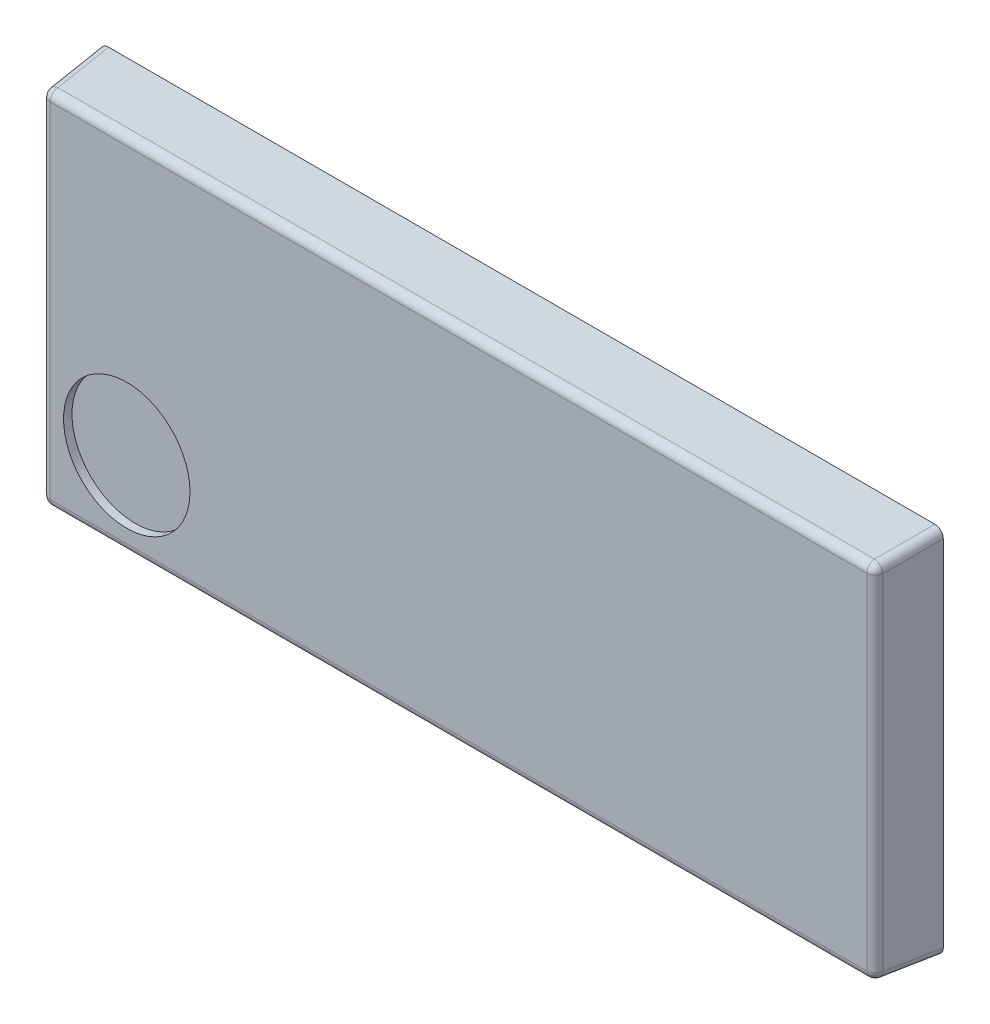
ISO-10303-21;
HEADER;
FILE_DESCRIPTION(('STEP AP214'),'2;1');
FILE_NAME('part.step','',(''),(''),'','','');
FILE_SCHEMA(('AUTOMOTIVE_DESIGN { 1 0 10303 214 1 1 1 1 }'));
ENDSEC;
DATA;
#1=APPLICATION_CONTEXT('core data for automotive mechanical design processes');
#2=APPLICATION_PROTOCOL_DEFINITION('international standard','automotive_design',2000,#1);
#3=PRODUCT_CONTEXT('',#1,'mechanical');
#4=PRODUCT('Part','Part','',(#3));
#5=PRODUCT_RELATED_PRODUCT_CATEGORY('part','',(#4));
#6=PRODUCT_DEFINITION_FORMATION('','',#4);
#7=PRODUCT_DEFINITION_CONTEXT('part definition',#1,'design');
#8=PRODUCT_DEFINITION('design','',#6,#7);
#9=PRODUCT_DEFINITION_SHAPE('','',#8);
#10=(LENGTH_UNIT() NAMED_UNIT(*) SI_UNIT(.MILLI.,.METRE.));
#11=(NAMED_UNIT(*) PLANE_ANGLE_UNIT() SI_UNIT($,.RADIAN.));
#12=(NAMED_UNIT(*) SI_UNIT($,.STERADIAN.) SOLID_ANGLE_UNIT());
#13=UNCERTAINTY_MEASURE_WITH_UNIT(LENGTH_MEASURE(1.E-05),#10,'distance_accuracy_value','');
#14=(GEOMETRIC_REPRESENTATION_CONTEXT(3) GLOBAL_UNCERTAINTY_ASSIGNED_CONTEXT((#13)) GLOBAL_UNIT_ASSIGNED_CONTEXT((#10,
#11,#12)) REPRESENTATION_CONTEXT('',''));
#15=CARTESIAN_POINT('',(0.,0.,0.));
#16=DIRECTION('',(0.,0.,1.));
#17=DIRECTION('',(1.,0.,0.));
#18=AXIS2_PLACEMENT_3D('',#15,#16,#17);
#19=CARTESIAN_POINT('',(-3.93438350235556,-1.13438350235556,0.65));
#20=DIRECTION('',(0.,0.,1.));
#21=DIRECTION('',(1.,0.,0.));
#22=AXIS2_PLACEMENT_3D('',#19,#20,#21);
#23=CYLINDRICAL_SURFACE('',#22,0.75);
#24=CARTESIAN_POINT('',(-3.93438350235556,-1.13438350235556,0.65));
#25=DIRECTION('',(0.,0.,1.));
#26=DIRECTION('',(1.,0.,0.));
#27=AXIS2_PLACEMENT_3D('',#24,#25,#26);
#28=CIRCLE('',#27,0.75);
#29=CARTESIAN_POINT('',(-3.18438350235556,-1.13438350235556,0.65));
#30=VERTEX_POINT('',#29);
#31=EDGE_CURVE('E11',#30,#30,#28,.T.);
#32=ORIENTED_EDGE('',*,*,#31,.F.);
#33=EDGE_LOOP('',(#32));
#34=FACE_BOUND('',#33,.T.);
#35=CARTESIAN_POINT('',(-3.93438350235556,-1.13438350235556,0.75));
#36=DIRECTION('',(0.,0.,-1.));
#37=DIRECTION('',(1.,0.,0.));
#38=AXIS2_PLACEMENT_3D('',#35,#36,#37);
#39=CIRCLE('',#38,0.75);
#40=CARTESIAN_POINT('',(-3.18438350235556,-1.13438350235556,0.75));
#41=VERTEX_POINT('',#40);
#42=EDGE_CURVE('E26',#41,#41,#39,.T.);
#43=ORIENTED_EDGE('',*,*,#42,.F.);
#44=EDGE_LOOP('',(#43));
#45=FACE_BOUND('',#44,.T.);
#46=ADVANCED_FACE('F16',(#34,#45),#23,.F.);
#47=CARTESIAN_POINT('',(-3.93438350235556,-1.13438350235556,0.65));
#48=DIRECTION('',(0.,0.,1.));
#49=DIRECTION('',(1.,0.,0.));
#50=AXIS2_PLACEMENT_3D('',#47,#48,#49);
#51=PLANE('',#50);
#52=ORIENTED_EDGE('',*,*,#31,.T.);
#53=EDGE_LOOP('',(#52));
#54=FACE_BOUND('',#53,.T.);
#55=ADVANCED_FACE('F352',(#54),#51,.T.);
#56=CARTESIAN_POINT('',(-5.,-2.2,0.75));
#57=DIRECTION('',(0.,0.,1.));
#58=DIRECTION('',(1.,0.,0.));
#59=AXIS2_PLACEMENT_3D('',#56,#57,#58);
#60=PLANE('',#59);
#61=DIRECTION('',(0.,1.,0.));
#62=VECTOR('',#61,1.);
#63=CARTESIAN_POINT('',(-4.84275038495381,-2.2,0.75));
#64=LINE('',#63,#62);
#65=CARTESIAN_POINT('',(-4.84275038495381,-2.04275038495382,0.75));
#66=VERTEX_POINT('',#65);
#67=CARTESIAN_POINT('',(-4.84275038495382,2.04275038495382,0.75));
#68=VERTEX_POINT('',#67);
#69=EDGE_CURVE('E253',#66,#68,#64,.T.);
#70=ORIENTED_EDGE('',*,*,#69,.F.);
#71=DIRECTION('',(-1.,0.,0.));
#72=VECTOR('',#71,1.);
#73=CARTESIAN_POINT('',(-5.,-2.04275038495382,0.75));
#74=LINE('',#73,#72);
#75=CARTESIAN_POINT('',(4.84275038495382,-2.04275038495382,0.75));
#76=VERTEX_POINT('',#75);
#77=EDGE_CURVE('E226',#76,#66,#74,.T.);
#78=ORIENTED_EDGE('',*,*,#77,.F.);
#79=DIRECTION('',(0.,-1.,0.));
#80=VECTOR('',#79,1.);
#81=CARTESIAN_POINT('',(4.84275038495382,-2.2,0.75));
#82=LINE('',#81,#80);
#83=CARTESIAN_POINT('',(4.84275038495382,2.04275038495382,0.75));
#84=VERTEX_POINT('',#83);
#85=EDGE_CURVE('E182',#84,#76,#82,.T.);
#86=ORIENTED_EDGE('',*,*,#85,.F.);
#87=DIRECTION('',(1.,0.,0.));
#88=VECTOR('',#87,1.);
#89=CARTESIAN_POINT('',(-5.,2.04275038495382,0.75));
#90=LINE('',#89,#88);
#91=EDGE_CURVE('E204',#68,#84,#90,.T.);
#92=ORIENTED_EDGE('',*,*,#91,.F.);
#93=EDGE_LOOP('',(#70,#78,#86,#92));
#94=FACE_BOUND('',#93,.T.);
#95=ORIENTED_EDGE('',*,*,#42,.T.);
#96=EDGE_LOOP('',(#95));
#97=FACE_BOUND('',#96,.T.);
#98=ADVANCED_FACE('F335',(#94,#97),#60,.T.);
#99=CARTESIAN_POINT('',(-4.84275038495382,2.04275038495382,0.65));
#100=DIRECTION('',(0.754900044750237,0.,0.655839860359288));
#101=DIRECTION('',(-0.35970845950189,-0.836170262039085,0.414039994498438));
#102=AXIS2_PLACEMENT_3D('',#99,#100,#101);
#103=SPHERICAL_SURFACE('',#102,0.0999999999999953);
#104=CARTESIAN_POINT('',(-4.84275038495382,2.04275038495382,0.65));
#105=DIRECTION('',(0.,-1.,0.));
#106=DIRECTION('',(1.,0.,0.));
#107=AXIS2_PLACEMENT_3D('',#104,#105,#106);
#108=CIRCLE('',#107,0.1);
#109=CARTESIAN_POINT('',(-4.94236985476299,2.04275038495382,0.658715574274766));
#110=VERTEX_POINT('',#109);
#111=EDGE_CURVE('E169',#68,#110,#108,.T.);
#112=ORIENTED_EDGE('',*,*,#111,.F.);
#113=CARTESIAN_POINT('',(-4.84275038495382,2.04275038495382,0.65));
#114=DIRECTION('',(1.,0.,0.));
#115=DIRECTION('',(0.,0.,1.));
#116=AXIS2_PLACEMENT_3D('',#113,#114,#115);
#117=CIRCLE('',#116,0.1);
#118=CARTESIAN_POINT('',(-4.84275038495382,2.14236985476299,0.658715574274766));
#119=VERTEX_POINT('',#118);
#120=EDGE_CURVE('E235',#119,#68,#117,.T.);
#121=ORIENTED_EDGE('',*,*,#120,.F.);
#122=CARTESIAN_POINT('',(-4.84275038495382,2.04275038495382,0.65));
#123=DIRECTION('',(-0.0868265938642476,0.0868265938642477,-0.992432509138967));
#124=DIRECTION('',(-0.996194698091746,0.,0.0871557427476582));
#125=AXIS2_PLACEMENT_3D('',#122,#123,#124);
#126=CIRCLE('',#125,0.1);
#127=EDGE_CURVE('E136',#110,#119,#126,.T.);
#128=ORIENTED_EDGE('',*,*,#127,.F.);
#129=EDGE_LOOP('',(#112,#121,#128));
#130=FACE_BOUND('',#129,.T.);
#131=ADVANCED_FACE('F360',(#130),#103,.T.);
#132=CARTESIAN_POINT('',(-4.84275038495381,-2.2,0.65));
#133=DIRECTION('',(0.,-1.,0.));
#134=DIRECTION('',(1.,0.,0.));
#135=AXIS2_PLACEMENT_3D('',#132,#133,#134);
#136=CYLINDRICAL_SURFACE('',#135,0.1);
#137=ORIENTED_EDGE('',*,*,#111,.T.);
#138=DIRECTION('',(0.,1.,0.));
#139=VECTOR('',#138,1.);
#140=CARTESIAN_POINT('',(-4.94236985476299,2.2,0.658715574274766));
#141=LINE('',#140,#139);
#142=CARTESIAN_POINT('',(-4.94236985476299,-2.04275038495382,0.658715574274766));
#143=VERTEX_POINT('',#142);
#144=EDGE_CURVE('E170',#143,#110,#141,.T.);
#145=ORIENTED_EDGE('',*,*,#144,.F.);
#146=CARTESIAN_POINT('',(-4.84275038495381,-2.04275038495382,0.65));
#147=DIRECTION('',(0.,-1.,0.));
#148=DIRECTION('',(1.,0.,0.));
#149=AXIS2_PLACEMENT_3D('',#146,#147,#148);
#150=CIRCLE('',#149,0.1);
#151=EDGE_CURVE('E257',#66,#143,#150,.T.);
#152=ORIENTED_EDGE('',*,*,#151,.F.);
#153=ORIENTED_EDGE('',*,*,#69,.T.);
#154=EDGE_LOOP('',(#137,#145,#152,#153));
#155=FACE_BOUND('',#154,.T.);
#156=ADVANCED_FACE('F333',(#155),#136,.T.);
#157=CARTESIAN_POINT('',(-4.84275038495381,-2.04275038495382,0.65));
#158=DIRECTION('',(0.754900044750258,0.,0.655839860359263));
#159=DIRECTION('',(0.359708459501881,-0.83617026203908,-0.414039994498455));
#160=AXIS2_PLACEMENT_3D('',#157,#158,#159);
#161=SPHERICAL_SURFACE('',#160,0.1);
#162=CARTESIAN_POINT('',(-4.84275038495381,-2.04275038495382,0.65));
#163=DIRECTION('',(-0.0868265938642476,-0.0868265938642476,-0.992432509138967));
#164=DIRECTION('',(0.,0.996194698091746,-0.0871557427476582));
#165=AXIS2_PLACEMENT_3D('',#162,#163,#164);
#166=CIRCLE('',#165,0.1);
#167=CARTESIAN_POINT('',(-4.84275038495381,-2.14236985476299,0.658715574274766));
#168=VERTEX_POINT('',#167);
#169=EDGE_CURVE('E173',#168,#143,#166,.T.);
#170=ORIENTED_EDGE('',*,*,#169,.F.);
#171=CARTESIAN_POINT('',(-4.84275038495381,-2.04275038495382,0.65));
#172=DIRECTION('',(1.,0.,0.));
#173=DIRECTION('',(0.,0.,-1.));
#174=AXIS2_PLACEMENT_3D('',#171,#172,#173);
#175=CIRCLE('',#174,0.1);
#176=EDGE_CURVE('E222',#66,#168,#175,.T.);
#177=ORIENTED_EDGE('',*,*,#176,.F.);
#178=ORIENTED_EDGE('',*,*,#151,.T.);
#179=EDGE_LOOP('',(#170,#177,#178));
#180=FACE_BOUND('',#179,.T.);
#181=ADVANCED_FACE('F322',(#180),#161,.T.);
#182=CARTESIAN_POINT('',(-5.,-2.04275038495382,0.65));
#183=DIRECTION('',(1.,0.,0.));
#184=DIRECTION('',(0.,0.,-1.));
#185=AXIS2_PLACEMENT_3D('',#182,#183,#184);
#186=CYLINDRICAL_SURFACE('',#185,0.1);
#187=CARTESIAN_POINT('',(4.84275038495382,-2.04275038495382,0.65));
#188=DIRECTION('',(1.,0.,0.));
#189=DIRECTION('',(0.,1.,0.));
#190=AXIS2_PLACEMENT_3D('',#187,#188,#189);
#191=CIRCLE('',#190,0.1);
#192=CARTESIAN_POINT('',(4.84275038495382,-2.14236985476299,0.658715574274766));
#193=VERTEX_POINT('',#192);
#194=EDGE_CURVE('E227',#76,#193,#191,.T.);
#195=ORIENTED_EDGE('',*,*,#194,.F.);
#196=ORIENTED_EDGE('',*,*,#77,.T.);
#197=ORIENTED_EDGE('',*,*,#176,.T.);
#198=DIRECTION('',(-1.,0.,0.));
#199=VECTOR('',#198,1.);
#200=CARTESIAN_POINT('',(-5.,-2.14236985476299,0.658715574274766));
#201=LINE('',#200,#199);
#202=EDGE_CURVE('E187',#193,#168,#201,.T.);
#203=ORIENTED_EDGE('',*,*,#202,.F.);
#204=EDGE_LOOP('',(#195,#196,#197,#203));
#205=FACE_BOUND('',#204,.T.);
#206=ADVANCED_FACE('F324',(#205),#186,.T.);
#207=CARTESIAN_POINT('',(4.84275038495382,-2.04275038495383,0.650000000000008));
#208=DIRECTION('',(0.754900044750239,0.,-0.655839860359286));
#209=DIRECTION('',(-0.359708459501833,-0.836170262039141,-0.414039994498374));
#210=AXIS2_PLACEMENT_3D('',#207,#208,#209);
#211=SPHERICAL_SURFACE('',#210,0.0999999999999815);
#212=CARTESIAN_POINT('',(4.84275038495382,-2.04275038495382,0.65));
#213=DIRECTION('',(0.0868265938642476,-0.0868265938642477,-0.992432509138967));
#214=DIRECTION('',(-0.996194698091746,0.,-0.0871557427476582));
#215=AXIS2_PLACEMENT_3D('',#212,#213,#214);
#216=CIRCLE('',#215,0.1);
#217=CARTESIAN_POINT('',(4.94236985476299,-2.04275038495382,0.658715574274766));
#218=VERTEX_POINT('',#217);
#219=EDGE_CURVE('E221',#218,#193,#216,.T.);
#220=ORIENTED_EDGE('',*,*,#219,.F.);
#221=CARTESIAN_POINT('',(4.84275038495382,-2.04275038495382,0.65));
#222=DIRECTION('',(0.,1.,0.));
#223=DIRECTION('',(-1.,0.,0.));
#224=AXIS2_PLACEMENT_3D('',#221,#222,#223);
#225=CIRCLE('',#224,0.1);
#226=EDGE_CURVE('E178',#76,#218,#225,.T.);
#227=ORIENTED_EDGE('',*,*,#226,.F.);
#228=ORIENTED_EDGE('',*,*,#194,.T.);
#229=EDGE_LOOP('',(#220,#227,#228));
#230=FACE_BOUND('',#229,.T.);
#231=ADVANCED_FACE('F347',(#230),#211,.T.);
#232=CARTESIAN_POINT('',(4.84275038495382,-2.2,0.65));
#233=DIRECTION('',(0.,1.,0.));
#234=DIRECTION('',(-1.,0.,0.));
#235=AXIS2_PLACEMENT_3D('',#232,#233,#234);
#236=CYLINDRICAL_SURFACE('',#235,0.1);
#237=CARTESIAN_POINT('',(4.84275038495381,2.04275038495382,0.65));
#238=DIRECTION('',(0.,1.,0.));
#239=DIRECTION('',(1.,0.,0.));
#240=AXIS2_PLACEMENT_3D('',#237,#238,#239);
#241=CIRCLE('',#240,0.1);
#242=CARTESIAN_POINT('',(4.94236985476299,2.04275038495382,0.658715574274766));
#243=VERTEX_POINT('',#242);
#244=EDGE_CURVE('E183',#84,#243,#241,.T.);
#245=ORIENTED_EDGE('',*,*,#244,.F.);
#246=ORIENTED_EDGE('',*,*,#85,.T.);
#247=ORIENTED_EDGE('',*,*,#226,.T.);
#248=DIRECTION('',(0.,-1.,0.));
#249=VECTOR('',#248,1.);
#250=CARTESIAN_POINT('',(4.94236985476299,2.2,0.658715574274766));
#251=LINE('',#250,#249);
#252=EDGE_CURVE('E198',#243,#218,#251,.T.);
#253=ORIENTED_EDGE('',*,*,#252,.F.);
#254=EDGE_LOOP('',(#245,#246,#247,#253));
#255=FACE_BOUND('',#254,.T.);
#256=ADVANCED_FACE('F338',(#255),#236,.T.);
#257=CARTESIAN_POINT('',(4.84275038495383,2.04275038495383,0.650000000000024));
#258=DIRECTION('',(0.754900044750219,0.,-0.655839860359308));
#259=DIRECTION('',(0.35970845950193,-0.836170262039056,0.414039994498461));
#260=AXIS2_PLACEMENT_3D('',#257,#258,#259);
#261=SPHERICAL_SURFACE('',#260,0.0999999999999689);
#262=ORIENTED_EDGE('',*,*,#244,.T.);
#263=CARTESIAN_POINT('',(4.84275038495382,2.04275038495382,0.65));
#264=DIRECTION('',(0.0868265938642476,0.0868265938642476,-0.992432509138967));
#265=DIRECTION('',(0.,0.996194698091746,0.0871557427476582));
#266=AXIS2_PLACEMENT_3D('',#263,#264,#265);
#267=CIRCLE('',#266,0.1);
#268=CARTESIAN_POINT('',(4.84275038495382,2.14236985476299,0.658715574274766));
#269=VERTEX_POINT('',#268);
#270=EDGE_CURVE('E164',#269,#243,#267,.T.);
#271=ORIENTED_EDGE('',*,*,#270,.F.);
#272=CARTESIAN_POINT('',(4.84275038495382,2.04275038495382,0.65));
#273=DIRECTION('',(-1.,0.,0.));
#274=DIRECTION('',(0.,0.,1.));
#275=AXIS2_PLACEMENT_3D('',#272,#273,#274);
#276=CIRCLE('',#275,0.1);
#277=EDGE_CURVE('E208',#84,#269,#276,.T.);
#278=ORIENTED_EDGE('',*,*,#277,.F.);
#279=EDGE_LOOP('',(#262,#271,#278));
#280=FACE_BOUND('',#279,.T.);
#281=ADVANCED_FACE('F339',(#280),#261,.T.);
#282=CARTESIAN_POINT('',(-5.,2.04275038495382,0.65));
#283=DIRECTION('',(-1.,0.,0.));
#284=DIRECTION('',(0.,0.,1.));
#285=AXIS2_PLACEMENT_3D('',#282,#283,#284);
#286=CYLINDRICAL_SURFACE('',#285,0.1);
#287=ORIENTED_EDGE('',*,*,#277,.T.);
#288=DIRECTION('',(1.,0.,0.));
#289=VECTOR('',#288,1.);
#290=CARTESIAN_POINT('',(-5.,2.14236985476299,0.658715574274766));
#291=LINE('',#290,#289);
#292=EDGE_CURVE('E142',#119,#269,#291,.T.);
#293=ORIENTED_EDGE('',*,*,#292,.F.);
#294=ORIENTED_EDGE('',*,*,#120,.T.);
#295=ORIENTED_EDGE('',*,*,#91,.T.);
#296=EDGE_LOOP('',(#287,#293,#294,#295));
#297=FACE_BOUND('',#296,.T.);
#298=ADVANCED_FACE('F275',(#297),#286,.T.);
#299=CARTESIAN_POINT('',(-4.90113154716819,2.10113154716819,-0.0172997376062625));
#300=DIRECTION('',(-0.0868265938642477,0.0868265938642477,-0.992432509138967));
#301=DIRECTION('',(-0.996194698091746,0.,0.0871557427476583));
#302=AXIS2_PLACEMENT_3D('',#299,#300,#301);
#303=CYLINDRICAL_SURFACE('',#302,0.1);
#304=ORIENTED_EDGE('',*,*,#127,.T.);
#305=DIRECTION('',(0.0868265938642481,-0.0868265938642475,0.992432509138967));
#306=VECTOR('',#305,1.);
#307=CARTESIAN_POINT('',(-4.90038053019083,2.2,0.));
#308=LINE('',#307,#306);
#309=CARTESIAN_POINT('',(-4.90038053019083,2.2,0.));
#310=VERTEX_POINT('',#309);
#311=EDGE_CURVE('E129',#310,#119,#308,.T.);
#312=ORIENTED_EDGE('',*,*,#311,.F.);
#313=CARTESIAN_POINT('',(-4.90038053019083,2.2,0.));
#314=CARTESIAN_POINT('',(-4.95882769356253,2.2,0.));
#315=CARTESIAN_POINT('',(-5.,2.15882769356253,0.));
#316=CARTESIAN_POINT('',(-5.,2.10038053019082,0.));
#317=(BOUNDED_CURVE() B_SPLINE_CURVE(3,(#313,#314,#315,#316),.UNSPECIFIED.,.F.,
.F.) B_SPLINE_CURVE_WITH_KNOTS((4,4),(5.50158524205542,7.06478537230375),
.UNSPECIFIED.) CURVE() GEOMETRIC_REPRESENTATION_ITEM() RATIONAL_B_SPLINE_CURVE((1.,
0.806524890385349,0.806524890385349,1.)) REPRESENTATION_ITEM(''));
#318=CARTESIAN_POINT('',(-5.,2.10038053019082,0.));
#319=VERTEX_POINT('',#318);
#320=EDGE_CURVE('E133',#310,#319,#317,.T.);
#321=ORIENTED_EDGE('',*,*,#320,.T.);
#322=DIRECTION('',(-0.0868265938642481,0.0868265938642481,-0.992432509138967));
#323=VECTOR('',#322,1.);
#324=CARTESIAN_POINT('',(-4.94236985476299,2.04275038495382,0.658715574274766));
#325=LINE('',#324,#323);
#326=EDGE_CURVE('E20',#110,#319,#325,.T.);
#327=ORIENTED_EDGE('',*,*,#326,.F.);
#328=EDGE_LOOP('',(#304,#312,#321,#327));
#329=FACE_BOUND('',#328,.T.);
#330=ADVANCED_FACE('F131',(#329),#303,.T.);
#331=CARTESIAN_POINT('',(-5.,2.2,0.));
#332=DIRECTION('',(-0.996194698091746,0.,0.0871557427476582));
#333=DIRECTION('',(0.,1.,0.));
#334=AXIS2_PLACEMENT_3D('',#331,#332,#333);
#335=PLANE('',#334);
#336=DIRECTION('',(0.,-1.,0.));
#337=VECTOR('',#336,1.);
#338=CARTESIAN_POINT('',(-5.,-2.2,0.));
#339=LINE('',#338,#337);
#340=CARTESIAN_POINT('',(-5.,-2.10038053019082,0.));
#341=VERTEX_POINT('',#340);
#342=EDGE_CURVE('E150',#319,#341,#339,.T.);
#343=ORIENTED_EDGE('',*,*,#342,.T.);
#344=DIRECTION('',(-0.0868265938642476,-0.0868265938642476,-0.992432509138967));
#345=VECTOR('',#344,1.);
#346=CARTESIAN_POINT('',(-5.00075101697736,-2.10113154716819,-0.0085841633314967));
#347=LINE('',#346,#345);
#348=EDGE_CURVE('E177',#143,#341,#347,.T.);
#349=ORIENTED_EDGE('',*,*,#348,.F.);
#350=ORIENTED_EDGE('',*,*,#144,.T.);
#351=ORIENTED_EDGE('',*,*,#326,.T.);
#352=EDGE_LOOP('',(#343,#349,#350,#351));
#353=FACE_BOUND('',#352,.T.);
#354=ADVANCED_FACE('F304',(#353),#335,.T.);
#355=CARTESIAN_POINT('',(-4.90113154716819,-2.10113154716819,-0.0172997376062625));
#356=DIRECTION('',(-0.0868265938642476,-0.0868265938642477,-0.992432509138967));
#357=DIRECTION('',(0.,0.996194698091746,-0.0871557427476583));
#358=AXIS2_PLACEMENT_3D('',#355,#356,#357);
#359=CYLINDRICAL_SURFACE('',#358,0.1);
#360=CARTESIAN_POINT('',(-5.,-2.10038053019082,0.));
#361=CARTESIAN_POINT('',(-5.,-2.15882769356253,0.));
#362=CARTESIAN_POINT('',(-4.95882769356253,-2.2,0.));
#363=CARTESIAN_POINT('',(-4.90038053019083,-2.2,0.));
#364=(BOUNDED_CURVE() B_SPLINE_CURVE(3,(#360,#361,#362,#363),.UNSPECIFIED.,.F.,
.F.) B_SPLINE_CURVE_WITH_KNOTS((4,4),(5.50158524205542,7.06478537230375),
.UNSPECIFIED.) CURVE() GEOMETRIC_REPRESENTATION_ITEM() RATIONAL_B_SPLINE_CURVE((1.,
0.806524890385349,0.806524890385349,1.)) REPRESENTATION_ITEM(''));
#365=CARTESIAN_POINT('',(-4.90038053019083,-2.2,0.));
#366=VERTEX_POINT('',#365);
#367=EDGE_CURVE('E176',#341,#366,#364,.T.);
#368=ORIENTED_EDGE('',*,*,#367,.T.);
#369=DIRECTION('',(-0.0868265938642481,-0.0868265938642475,-0.992432509138967));
#370=VECTOR('',#369,1.);
#371=CARTESIAN_POINT('',(-4.84275038495381,-2.14236985476299,0.658715574274766));
#372=LINE('',#371,#370);
#373=EDGE_CURVE('E184',#168,#366,#372,.T.);
#374=ORIENTED_EDGE('',*,*,#373,.F.);
#375=ORIENTED_EDGE('',*,*,#169,.T.);
#376=ORIENTED_EDGE('',*,*,#348,.T.);
#377=EDGE_LOOP('',(#368,#374,#375,#376));
#378=FACE_BOUND('',#377,.T.);
#379=ADVANCED_FACE('F299',(#378),#359,.T.);
#380=CARTESIAN_POINT('',(-5.,-2.2,0.));
#381=DIRECTION('',(0.,-0.996194698091746,0.0871557427476582));
#382=DIRECTION('',(-1.,0.,0.));
#383=AXIS2_PLACEMENT_3D('',#380,#381,#382);
#384=PLANE('',#383);
#385=ORIENTED_EDGE('',*,*,#202,.T.);
#386=ORIENTED_EDGE('',*,*,#373,.T.);
#387=DIRECTION('',(1.,0.,0.));
#388=VECTOR('',#387,1.);
#389=CARTESIAN_POINT('',(-5.,-2.2,0.));
#390=LINE('',#389,#388);
#391=CARTESIAN_POINT('',(4.90038053019083,-2.2,0.));
#392=VERTEX_POINT('',#391);
#393=EDGE_CURVE('E188',#366,#392,#390,.T.);
#394=ORIENTED_EDGE('',*,*,#393,.T.);
#395=DIRECTION('',(0.0868265938642477,-0.0868265938642476,-0.992432509138967));
#396=VECTOR('',#395,1.);
#397=CARTESIAN_POINT('',(4.86796057459909,-2.16758004440827,0.370561788066719));
#398=LINE('',#397,#396);
#399=EDGE_CURVE('E197',#193,#392,#398,.T.);
#400=ORIENTED_EDGE('',*,*,#399,.F.);
#401=EDGE_LOOP('',(#385,#386,#394,#400));
#402=FACE_BOUND('',#401,.T.);
#403=ADVANCED_FACE('F296',(#402),#384,.T.);
#404=CARTESIAN_POINT('',(4.86796057459909,-2.06796057459909,0.361846213791953));
#405=DIRECTION('',(0.0868265938642476,-0.0868265938642477,-0.992432509138967));
#406=DIRECTION('',(-0.996194698091746,0.,-0.0871557427476582));
#407=AXIS2_PLACEMENT_3D('',#404,#405,#406);
#408=CYLINDRICAL_SURFACE('',#407,0.1);
#409=ORIENTED_EDGE('',*,*,#219,.T.);
#410=ORIENTED_EDGE('',*,*,#399,.T.);
#411=CARTESIAN_POINT('',(4.90038053019083,-2.2,0.));
#412=CARTESIAN_POINT('',(4.95882769356253,-2.2,0.));
#413=CARTESIAN_POINT('',(5.,-2.15882769356253,0.));
#414=CARTESIAN_POINT('',(5.,-2.10038053019082,0.));
#415=(BOUNDED_CURVE() B_SPLINE_CURVE(3,(#411,#412,#413,#414),.UNSPECIFIED.,.F.,
.F.) B_SPLINE_CURVE_WITH_KNOTS((4,4),(5.50158524205541,7.06478537230375),
.UNSPECIFIED.) CURVE() GEOMETRIC_REPRESENTATION_ITEM() RATIONAL_B_SPLINE_CURVE((1.,
0.806524890385347,0.806524890385347,1.)) REPRESENTATION_ITEM(''));
#416=CARTESIAN_POINT('',(5.,-2.10038053019082,0.));
#417=VERTEX_POINT('',#416);
#418=EDGE_CURVE('E191',#392,#417,#415,.T.);
#419=ORIENTED_EDGE('',*,*,#418,.T.);
#420=DIRECTION('',(0.0868265938642481,-0.0868265938642481,-0.992432509138967));
#421=VECTOR('',#420,1.);
#422=CARTESIAN_POINT('',(4.94236985476299,-2.04275038495382,0.658715574274766));
#423=LINE('',#422,#421);
#424=EDGE_CURVE('E248',#218,#417,#423,.T.);
#425=ORIENTED_EDGE('',*,*,#424,.F.);
#426=EDGE_LOOP('',(#409,#410,#419,#425));
#427=FACE_BOUND('',#426,.T.);
#428=ADVANCED_FACE('F18',(#427),#408,.T.);
#429=CARTESIAN_POINT('',(5.,2.2,0.));
#430=DIRECTION('',(0.996194698091746,0.,0.0871557427476582));
#431=DIRECTION('',(0.,-1.,0.));
#432=AXIS2_PLACEMENT_3D('',#429,#430,#431);
#433=PLANE('',#432);
#434=ORIENTED_EDGE('',*,*,#252,.T.);
#435=ORIENTED_EDGE('',*,*,#424,.T.);
#436=DIRECTION('',(0.,1.,0.));
#437=VECTOR('',#436,1.);
#438=CARTESIAN_POINT('',(5.,-2.2,0.));
#439=LINE('',#438,#437);
#440=CARTESIAN_POINT('',(5.,2.10038053019082,0.));
#441=VERTEX_POINT('',#440);
#442=EDGE_CURVE('E213',#417,#441,#439,.T.);
#443=ORIENTED_EDGE('',*,*,#442,.T.);
#444=DIRECTION('',(0.0868265938642476,0.0868265938642476,-0.992432509138967));
#445=VECTOR('',#444,1.);
#446=CARTESIAN_POINT('',(4.92536244295669,2.02574297314751,0.853111180755357));
#447=LINE('',#446,#445);
#448=EDGE_CURVE('E158',#243,#441,#447,.T.);
#449=ORIENTED_EDGE('',*,*,#448,.F.);
#450=EDGE_LOOP('',(#434,#435,#443,#449));
#451=FACE_BOUND('',#450,.T.);
#452=ADVANCED_FACE('F287',(#451),#433,.T.);
#453=CARTESIAN_POINT('',(4.82574297314752,2.02574297314751,0.844395606480591));
#454=DIRECTION('',(0.0868265938642476,0.0868265938642476,-0.992432509138967));
#455=DIRECTION('',(0.,0.996194698091746,0.0871557427476582));
#456=AXIS2_PLACEMENT_3D('',#453,#454,#455);
#457=CYLINDRICAL_SURFACE('',#456,0.1);
#458=CARTESIAN_POINT('',(5.,2.10038053019082,0.));
#459=CARTESIAN_POINT('',(5.,2.15882769356253,0.));
#460=CARTESIAN_POINT('',(4.95882769356253,2.2,0.));
#461=CARTESIAN_POINT('',(4.90038053019083,2.2,0.));
#462=(BOUNDED_CURVE() B_SPLINE_CURVE(3,(#458,#459,#460,#461),.UNSPECIFIED.,.F.,
.F.) B_SPLINE_CURVE_WITH_KNOTS((4,4),(5.50158524205542,7.06478537230375),
.UNSPECIFIED.) CURVE() GEOMETRIC_REPRESENTATION_ITEM() RATIONAL_B_SPLINE_CURVE((1.,
0.806524890385349,0.806524890385349,1.)) REPRESENTATION_ITEM(''));
#463=CARTESIAN_POINT('',(4.90038053019083,2.2,0.));
#464=VERTEX_POINT('',#463);
#465=EDGE_CURVE('E209',#441,#464,#462,.T.);
#466=ORIENTED_EDGE('',*,*,#465,.T.);
#467=DIRECTION('',(0.0868265938642481,0.0868265938642475,-0.992432509138967));
#468=VECTOR('',#467,1.);
#469=CARTESIAN_POINT('',(4.84275038495382,2.14236985476299,0.658715574274766));
#470=LINE('',#469,#468);
#471=EDGE_CURVE('E155',#269,#464,#470,.T.);
#472=ORIENTED_EDGE('',*,*,#471,.F.);
#473=ORIENTED_EDGE('',*,*,#270,.T.);
#474=ORIENTED_EDGE('',*,*,#448,.T.);
#475=EDGE_LOOP('',(#466,#472,#473,#474));
#476=FACE_BOUND('',#475,.T.);
#477=ADVANCED_FACE('F280',(#476),#457,.T.);
#478=CARTESIAN_POINT('',(-5.,2.2,0.));
#479=DIRECTION('',(0.,0.996194698091746,0.0871557427476582));
#480=DIRECTION('',(1.,0.,0.));
#481=AXIS2_PLACEMENT_3D('',#478,#479,#480);
#482=PLANE('',#481);
#483=DIRECTION('',(-1.,0.,0.));
#484=VECTOR('',#483,1.);
#485=CARTESIAN_POINT('',(-5.,2.2,0.));
#486=LINE('',#485,#484);
#487=EDGE_CURVE('E141',#464,#310,#486,.T.);
#488=ORIENTED_EDGE('',*,*,#487,.T.);
#489=ORIENTED_EDGE('',*,*,#311,.T.);
#490=ORIENTED_EDGE('',*,*,#292,.T.);
#491=ORIENTED_EDGE('',*,*,#471,.T.);
#492=EDGE_LOOP('',(#488,#489,#490,#491));
#493=FACE_BOUND('',#492,.T.);
#494=ADVANCED_FACE('F153',(#493),#482,.T.);
#495=CARTESIAN_POINT('',(-5.,-2.2,0.));
#496=DIRECTION('',(0.,0.,1.));
#497=DIRECTION('',(1.,0.,0.));
#498=AXIS2_PLACEMENT_3D('',#495,#496,#497);
#499=PLANE('',#498);
#500=ORIENTED_EDGE('',*,*,#465,.F.);
#501=ORIENTED_EDGE('',*,*,#442,.F.);
#502=ORIENTED_EDGE('',*,*,#418,.F.);
#503=ORIENTED_EDGE('',*,*,#393,.F.);
#504=ORIENTED_EDGE('',*,*,#367,.F.);
#505=ORIENTED_EDGE('',*,*,#342,.F.);
#506=ORIENTED_EDGE('',*,*,#320,.F.);
#507=ORIENTED_EDGE('',*,*,#487,.F.);
#508=EDGE_LOOP('',(#500,#501,#502,#503,#504,#505,#506,#507));
#509=FACE_BOUND('',#508,.T.);
#510=ADVANCED_FACE('F147',(#509),#499,.F.);
#511=CLOSED_SHELL('',(#46,#55,#98,#131,#156,#181,#206,#231,#256,#281,#298,#330,#354,#379,#403,
#428,#452,#477,#494,#510));
#512=MANIFOLD_SOLID_BREP('B1',#511);
#513=ADVANCED_BREP_SHAPE_REPRESENTATION('',(#18,#512),#14);
#514=SHAPE_DEFINITION_REPRESENTATION(#9,#513);
ENDSEC;
END-ISO-10303-21;
